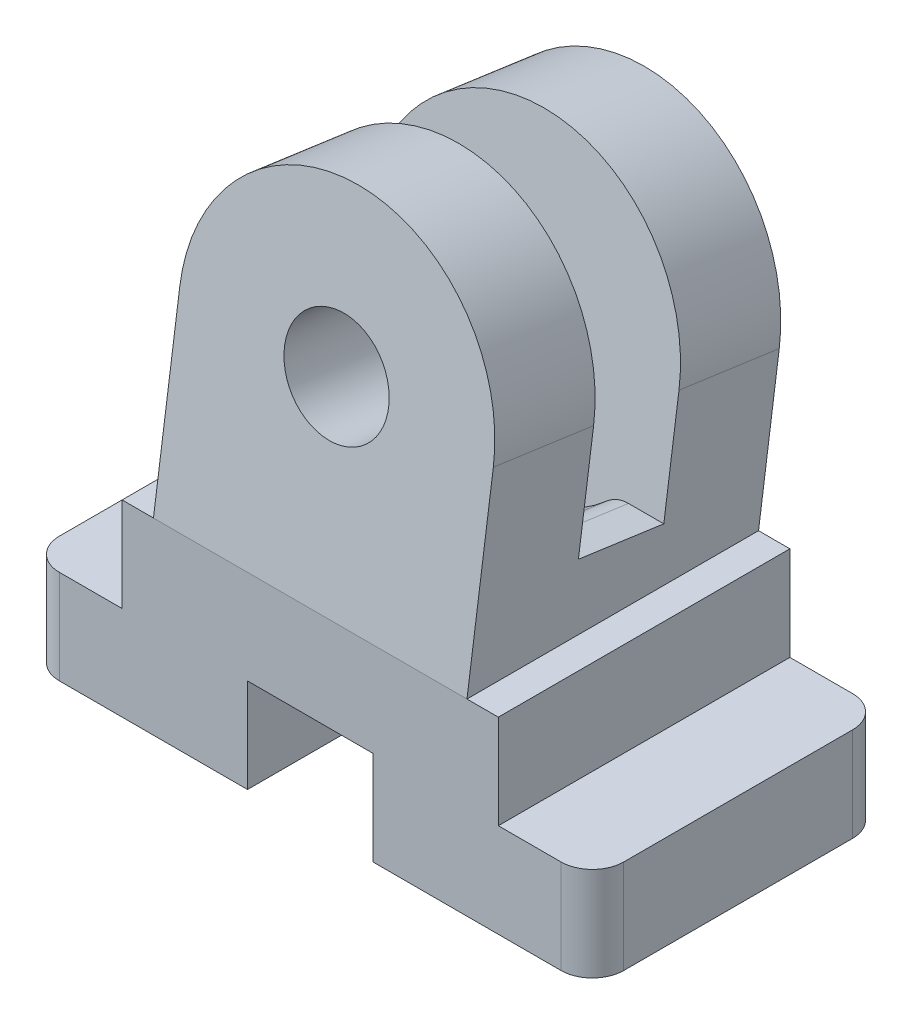
ISO-10303-21;
HEADER;
FILE_DESCRIPTION(('STEP AP214'),'2;1');
FILE_NAME('part.step','',(''),(''),'','','');
FILE_SCHEMA(('AUTOMOTIVE_DESIGN { 1 0 10303 214 1 1 1 1 }'));
ENDSEC;
DATA;
#1=APPLICATION_CONTEXT('core data for automotive mechanical design processes');
#2=APPLICATION_PROTOCOL_DEFINITION('international standard','automotive_design',2000,#1);
#3=PRODUCT_CONTEXT('',#1,'mechanical');
#4=PRODUCT('Part','Part','',(#3));
#5=PRODUCT_RELATED_PRODUCT_CATEGORY('part','',(#4));
#6=PRODUCT_DEFINITION_FORMATION('','',#4);
#7=PRODUCT_DEFINITION_CONTEXT('part definition',#1,'design');
#8=PRODUCT_DEFINITION('design','',#6,#7);
#9=PRODUCT_DEFINITION_SHAPE('','',#8);
#10=(LENGTH_UNIT() NAMED_UNIT(*) SI_UNIT(.MILLI.,.METRE.));
#11=(NAMED_UNIT(*) PLANE_ANGLE_UNIT() SI_UNIT($,.RADIAN.));
#12=(NAMED_UNIT(*) SI_UNIT($,.STERADIAN.) SOLID_ANGLE_UNIT());
#13=UNCERTAINTY_MEASURE_WITH_UNIT(LENGTH_MEASURE(1.E-05),#10,'distance_accuracy_value','');
#14=(GEOMETRIC_REPRESENTATION_CONTEXT(3) GLOBAL_UNCERTAINTY_ASSIGNED_CONTEXT((#13)) GLOBAL_UNIT_ASSIGNED_CONTEXT((#10,
#11,#12)) REPRESENTATION_CONTEXT('',''));
#15=CARTESIAN_POINT('',(0.,0.,0.));
#16=DIRECTION('',(0.,0.,1.));
#17=DIRECTION('',(1.,0.,0.));
#18=AXIS2_PLACEMENT_3D('',#15,#16,#17);
#19=CARTESIAN_POINT('',(-5.,0.307577926005134,2.18853066197066));
#20=DIRECTION('',(0.,0.139173100960066,0.99026806874157));
#21=DIRECTION('',(0.,-0.99026806874157,0.139173100960066));
#22=AXIS2_PLACEMENT_3D('',#19,#20,#21);
#23=PLANE('',#22);
#24=CARTESIAN_POINT('',(0.,11.5321199850963,0.611024151833874));
#25=DIRECTION('',(0.,0.139173100960066,0.99026806874157));
#26=DIRECTION('',(0.,-0.99026806874157,0.139173100960066));
#27=AXIS2_PLACEMENT_3D('',#24,#25,#26);
#28=CIRCLE('',#27,1.6625);
#29=CARTESIAN_POINT('',(0.,9.88579932081348,0.842399432179984));
#30=VERTEX_POINT('',#29);
#31=EDGE_CURVE('E600',#30,#30,#28,.T.);
#32=ORIENTED_EDGE('',*,*,#31,.T.);
#33=EDGE_LOOP('',(#32));
#34=FACE_BOUND('',#33,.T.);
#35=DIRECTION('',(1.,0.,0.));
#36=VECTOR('',#35,1.);
#37=CARTESIAN_POINT('',(3.48250089734375,8.08351054709297,1.09569460081341));
#38=LINE('',#37,#36);
#39=CARTESIAN_POINT('',(3.87463684818494,8.08351054709297,1.09569460081341));
#40=VERTEX_POINT('',#39);
#41=CARTESIAN_POINT('',(5.,8.08351054709297,1.09569460081341));
#42=VERTEX_POINT('',#41);
#43=EDGE_CURVE('E583',#40,#42,#38,.T.);
#44=ORIENTED_EDGE('',*,*,#43,.F.);
#45=CARTESIAN_POINT('',(3.87463684818494,7.0932424783514,1.23486770177348));
#46=DIRECTION('',(0.,0.139173100960066,0.99026806874157));
#47=DIRECTION('',(0.,-0.99026806874157,0.139173100960066));
#48=AXIS2_PLACEMENT_3D('',#45,#46,#47);
#49=CIRCLE('',#48,1.);
#50=CARTESIAN_POINT('',(3.22068970081196,7.84242011662059,1.12957765115076));
#51=VERTEX_POINT('',#50);
#52=EDGE_CURVE('E98',#40,#51,#49,.T.);
#53=ORIENTED_EDGE('',*,*,#52,.T.);
#54=CARTESIAN_POINT('',(0.,11.5321199850963,0.611024151833875));
#55=DIRECTION('',(0.,0.139173100960066,0.99026806874157));
#56=DIRECTION('',(0.,-0.99026806874157,0.139173100960066));
#57=AXIS2_PLACEMENT_3D('',#54,#55,#56);
#58=CIRCLE('',#57,4.925);
#59=CARTESIAN_POINT('',(-3.22068970081196,7.84242011662059,1.12957765115076));
#60=VERTEX_POINT('',#59);
#61=EDGE_CURVE('E582',#60,#51,#58,.T.);
#62=ORIENTED_EDGE('',*,*,#61,.F.);
#63=CARTESIAN_POINT('',(-3.87463684818494,7.0932424783514,1.23486770177348));
#64=DIRECTION('',(0.,0.139173100960066,0.99026806874157));
#65=DIRECTION('',(0.,-0.99026806874157,0.139173100960066));
#66=AXIS2_PLACEMENT_3D('',#63,#64,#65);
#67=CIRCLE('',#66,1.);
#68=CARTESIAN_POINT('',(-3.87463684818494,8.08351054709297,1.09569460081341));
#69=VERTEX_POINT('',#68);
#70=EDGE_CURVE('E576',#60,#69,#67,.T.);
#71=ORIENTED_EDGE('',*,*,#70,.T.);
#72=DIRECTION('',(1.,0.,0.));
#73=VECTOR('',#72,1.);
#74=CARTESIAN_POINT('',(-3.48250089734375,8.08351054709297,1.09569460081341));
#75=LINE('',#74,#73);
#76=CARTESIAN_POINT('',(-5.,8.08351054709297,1.09569460081341));
#77=VERTEX_POINT('',#76);
#78=EDGE_CURVE('E286',#77,#69,#75,.T.);
#79=ORIENTED_EDGE('',*,*,#78,.F.);
#80=DIRECTION('',(0.,-0.99026806874157,0.139173100960066));
#81=VECTOR('',#80,1.);
#82=CARTESIAN_POINT('',(-5.,0.307577926005134,2.18853066197066));
#83=LINE('',#82,#81);
#84=CARTESIAN_POINT('',(-5.,11.5321199850963,0.611024151833876));
#85=VERTEX_POINT('',#84);
#86=EDGE_CURVE('E282',#85,#77,#83,.T.);
#87=ORIENTED_EDGE('',*,*,#86,.F.);
#88=CARTESIAN_POINT('',(0.,11.5321199850963,0.611024151833877));
#89=DIRECTION('',(0.,0.139173100960066,0.99026806874157));
#90=DIRECTION('',(0.,-0.99026806874157,0.139173100960066));
#91=AXIS2_PLACEMENT_3D('',#88,#89,#90);
#92=CIRCLE('',#91,5.);
#93=CARTESIAN_POINT('',(5.,11.5321199850964,0.611024151833878));
#94=VERTEX_POINT('',#93);
#95=EDGE_CURVE('E472',#94,#85,#92,.T.);
#96=ORIENTED_EDGE('',*,*,#95,.F.);
#97=DIRECTION('',(0.,-0.99026806874157,0.139173100960066));
#98=VECTOR('',#97,1.);
#99=CARTESIAN_POINT('',(5.,0.307577926005134,2.18853066197066));
#100=LINE('',#99,#98);
#101=EDGE_CURVE('E332',#94,#42,#100,.T.);
#102=ORIENTED_EDGE('',*,*,#101,.T.);
#103=EDGE_LOOP('',(#44,#53,#62,#71,#79,#87,#96,#102));
#104=FACE_BOUND('',#103,.T.);
#105=ADVANCED_FACE('F90',(#34,#104),#23,.F.);
#106=CARTESIAN_POINT('',(-5.,-0.0751481016350465,-0.53470652706866));
#107=DIRECTION('',(0.,-0.139173100960066,-0.99026806874157));
#108=DIRECTION('',(0.,0.99026806874157,-0.139173100960066));
#109=AXIS2_PLACEMENT_3D('',#106,#107,#108);
#110=PLANE('',#109);
#111=CARTESIAN_POINT('',(0.,11.1493939574562,-2.11221303720544));
#112=DIRECTION('',(0.,-0.139173100960066,-0.99026806874157));
#113=DIRECTION('',(0.,0.99026806874157,-0.139173100960066));
#114=AXIS2_PLACEMENT_3D('',#111,#112,#113);
#115=CIRCLE('',#114,1.6625);
#116=CARTESIAN_POINT('',(0.,12.795714621739,-2.34358831755155));
#117=VERTEX_POINT('',#116);
#118=EDGE_CURVE('E597',#117,#117,#115,.T.);
#119=ORIENTED_EDGE('',*,*,#118,.T.);
#120=EDGE_LOOP('',(#119));
#121=FACE_BOUND('',#120,.T.);
#122=CARTESIAN_POINT('',(0.,11.1493939574562,-2.11221303720544));
#123=DIRECTION('',(0.,-0.139173100960066,-0.99026806874157));
#124=DIRECTION('',(0.,0.99026806874157,-0.139173100960066));
#125=AXIS2_PLACEMENT_3D('',#122,#123,#124);
#126=CIRCLE('',#125,4.925);
#127=CARTESIAN_POINT('',(-3.22068970081196,7.45969408898041,-1.59365953788855));
#128=VERTEX_POINT('',#127);
#129=CARTESIAN_POINT('',(3.22068970081196,7.45969408898041,-1.59365953788855));
#130=VERTEX_POINT('',#129);
#131=EDGE_CURVE('E295',#128,#130,#126,.F.);
#132=ORIENTED_EDGE('',*,*,#131,.T.);
#133=CARTESIAN_POINT('',(3.87463684818494,6.71051645071122,-1.48836948726584));
#134=DIRECTION('',(0.,-0.139173100960066,-0.99026806874157));
#135=DIRECTION('',(0.,0.99026806874157,-0.139173100960066));
#136=AXIS2_PLACEMENT_3D('',#133,#134,#135);
#137=CIRCLE('',#136,1.);
#138=CARTESIAN_POINT('',(3.87463684818494,7.70078451945279,-1.6275425882259));
#139=VERTEX_POINT('',#138);
#140=EDGE_CURVE('E13',#130,#139,#137,.T.);
#141=ORIENTED_EDGE('',*,*,#140,.T.);
#142=DIRECTION('',(1.,0.,0.));
#143=VECTOR('',#142,1.);
#144=CARTESIAN_POINT('',(3.48250089734375,7.70078451945279,-1.6275425882259));
#145=LINE('',#144,#143);
#146=CARTESIAN_POINT('',(5.,7.70078451945279,-1.6275425882259));
#147=VERTEX_POINT('',#146);
#148=EDGE_CURVE('E475',#139,#147,#145,.T.);
#149=ORIENTED_EDGE('',*,*,#148,.T.);
#150=DIRECTION('',(0.,0.99026806874157,-0.139173100960066));
#151=VECTOR('',#150,1.);
#152=CARTESIAN_POINT('',(5.,-0.0751481016350465,-0.53470652706866));
#153=LINE('',#152,#151);
#154=CARTESIAN_POINT('',(5.,11.1493939574562,-2.11221303720544));
#155=VERTEX_POINT('',#154);
#156=EDGE_CURVE('E308',#147,#155,#153,.T.);
#157=ORIENTED_EDGE('',*,*,#156,.T.);
#158=CARTESIAN_POINT('',(0.,11.1493939574562,-2.11221303720544));
#159=DIRECTION('',(0.,-0.139173100960066,-0.99026806874157));
#160=DIRECTION('',(0.,0.99026806874157,-0.139173100960066));
#161=AXIS2_PLACEMENT_3D('',#158,#159,#160);
#162=CIRCLE('',#161,5.);
#163=CARTESIAN_POINT('',(-5.,11.1493939574562,-2.11221303720544));
#164=VERTEX_POINT('',#163);
#165=EDGE_CURVE('E300',#164,#155,#162,.T.);
#166=ORIENTED_EDGE('',*,*,#165,.F.);
#167=DIRECTION('',(0.,0.99026806874157,-0.139173100960066));
#168=VECTOR('',#167,1.);
#169=CARTESIAN_POINT('',(-5.,-0.0751481016350465,-0.53470652706866));
#170=LINE('',#169,#168);
#171=CARTESIAN_POINT('',(-5.,7.70078451945279,-1.6275425882259));
#172=VERTEX_POINT('',#171);
#173=EDGE_CURVE('E278',#172,#164,#170,.T.);
#174=ORIENTED_EDGE('',*,*,#173,.F.);
#175=DIRECTION('',(1.,0.,0.));
#176=VECTOR('',#175,1.);
#177=CARTESIAN_POINT('',(-3.48250089734375,7.70078451945279,-1.6275425882259));
#178=LINE('',#177,#176);
#179=CARTESIAN_POINT('',(-3.87463684818494,7.70078451945279,-1.6275425882259));
#180=VERTEX_POINT('',#179);
#181=EDGE_CURVE('E290',#172,#180,#178,.T.);
#182=ORIENTED_EDGE('',*,*,#181,.T.);
#183=CARTESIAN_POINT('',(-3.87463684818494,6.71051645071122,-1.48836948726584));
#184=DIRECTION('',(0.,-0.139173100960066,-0.99026806874157));
#185=DIRECTION('',(0.,0.99026806874157,-0.139173100960066));
#186=AXIS2_PLACEMENT_3D('',#183,#184,#185);
#187=CIRCLE('',#186,1.);
#188=EDGE_CURVE('E578',#180,#128,#187,.T.);
#189=ORIENTED_EDGE('',*,*,#188,.T.);
#190=EDGE_LOOP('',(#132,#141,#149,#157,#166,#174,#182,#189));
#191=FACE_BOUND('',#190,.T.);
#192=ADVANCED_FACE('F298',(#121,#191),#110,.F.);
#193=CARTESIAN_POINT('',(0.,6.,0.));
#194=DIRECTION('',(0.,1.,0.));
#195=DIRECTION('',(0.,0.,1.));
#196=AXIS2_PLACEMENT_3D('',#193,#194,#195);
#197=PLANE('',#196);
#198=DIRECTION('',(-1.,0.,0.));
#199=VECTOR('',#198,1.);
#200=CARTESIAN_POINT('',(-6.,6.,-4.65));
#201=LINE('',#200,#199);
#202=CARTESIAN_POINT('',(6.,6.,-4.65));
#203=VERTEX_POINT('',#202);
#204=CARTESIAN_POINT('',(5.,6.,-4.65));
#205=VERTEX_POINT('',#204);
#206=EDGE_CURVE('E349',#203,#205,#201,.T.);
#207=ORIENTED_EDGE('',*,*,#206,.T.);
#208=DIRECTION('',(0.,0.,1.));
#209=VECTOR('',#208,1.);
#210=CARTESIAN_POINT('',(5.,6.,0.));
#211=LINE('',#210,#209);
#212=CARTESIAN_POINT('',(5.,6.,4.65));
#213=VERTEX_POINT('',#212);
#214=EDGE_CURVE('E337',#205,#213,#211,.T.);
#215=ORIENTED_EDGE('',*,*,#214,.T.);
#216=DIRECTION('',(1.,0.,0.));
#217=VECTOR('',#216,1.);
#218=CARTESIAN_POINT('',(-6.,6.,4.65));
#219=LINE('',#218,#217);
#220=CARTESIAN_POINT('',(6.,6.,4.65));
#221=VERTEX_POINT('',#220);
#222=EDGE_CURVE('E385',#213,#221,#219,.T.);
#223=ORIENTED_EDGE('',*,*,#222,.T.);
#224=DIRECTION('',(0.,0.,-1.));
#225=VECTOR('',#224,1.);
#226=CARTESIAN_POINT('',(6.,6.,-4.65));
#227=LINE('',#226,#225);
#228=EDGE_CURVE('E359',#221,#203,#227,.T.);
#229=ORIENTED_EDGE('',*,*,#228,.T.);
#230=EDGE_LOOP('',(#207,#215,#223,#229));
#231=FACE_BOUND('',#230,.T.);
#232=ADVANCED_FACE('F450',(#231),#197,.T.);
#233=DIRECTION('',(0.,0.,1.));
#234=VECTOR('',#233,1.);
#235=CARTESIAN_POINT('',(-5.,6.,0.));
#236=LINE('',#235,#234);
#237=CARTESIAN_POINT('',(-5.,6.,-4.65));
#238=VERTEX_POINT('',#237);
#239=CARTESIAN_POINT('',(-5.,6.,4.65));
#240=VERTEX_POINT('',#239);
#241=EDGE_CURVE('E346',#238,#240,#236,.T.);
#242=ORIENTED_EDGE('',*,*,#241,.F.);
#243=CARTESIAN_POINT('',(-6.,6.,-4.65));
#244=VERTEX_POINT('',#243);
#245=EDGE_CURVE('E354',#238,#244,#201,.T.);
#246=ORIENTED_EDGE('',*,*,#245,.T.);
#247=DIRECTION('',(0.,0.,1.));
#248=VECTOR('',#247,1.);
#249=CARTESIAN_POINT('',(-6.,6.,-4.65));
#250=LINE('',#249,#248);
#251=CARTESIAN_POINT('',(-6.,6.,4.65));
#252=VERTEX_POINT('',#251);
#253=EDGE_CURVE('E371',#244,#252,#250,.T.);
#254=ORIENTED_EDGE('',*,*,#253,.T.);
#255=EDGE_CURVE('E381',#252,#240,#219,.T.);
#256=ORIENTED_EDGE('',*,*,#255,.T.);
#257=EDGE_LOOP('',(#242,#246,#254,#256));
#258=FACE_BOUND('',#257,.T.);
#259=ADVANCED_FACE('F404',(#258),#197,.T.);
#260=CARTESIAN_POINT('',(0.,3.,0.));
#261=DIRECTION('',(0.,1.,0.));
#262=DIRECTION('',(0.,0.,1.));
#263=AXIS2_PLACEMENT_3D('',#260,#261,#262);
#264=PLANE('',#263);
#265=DIRECTION('',(0.,0.,-1.));
#266=VECTOR('',#265,1.);
#267=CARTESIAN_POINT('',(9.,3.,-4.65));
#268=LINE('',#267,#266);
#269=CARTESIAN_POINT('',(9.,3.,3.65));
#270=VERTEX_POINT('',#269);
#271=CARTESIAN_POINT('',(9.,3.,-3.65));
#272=VERTEX_POINT('',#271);
#273=EDGE_CURVE('E486',#270,#272,#268,.T.);
#274=ORIENTED_EDGE('',*,*,#273,.T.);
#275=CARTESIAN_POINT('',(8.,3.,-3.65));
#276=DIRECTION('',(0.,1.,0.));
#277=DIRECTION('',(0.,0.,1.));
#278=AXIS2_PLACEMENT_3D('',#275,#276,#277);
#279=CIRCLE('',#278,1.);
#280=CARTESIAN_POINT('',(8.,3.,-4.65));
#281=VERTEX_POINT('',#280);
#282=EDGE_CURVE('E313',#272,#281,#279,.T.);
#283=ORIENTED_EDGE('',*,*,#282,.T.);
#284=DIRECTION('',(-1.,0.,0.));
#285=VECTOR('',#284,1.);
#286=CARTESIAN_POINT('',(-9.,3.,-4.65));
#287=LINE('',#286,#285);
#288=CARTESIAN_POINT('',(6.,3.,-4.65));
#289=VERTEX_POINT('',#288);
#290=EDGE_CURVE('E481',#281,#289,#287,.T.);
#291=ORIENTED_EDGE('',*,*,#290,.T.);
#292=DIRECTION('',(0.,0.,-1.));
#293=VECTOR('',#292,1.);
#294=CARTESIAN_POINT('',(6.,3.,-4.65));
#295=LINE('',#294,#293);
#296=CARTESIAN_POINT('',(6.,3.,4.65));
#297=VERTEX_POINT('',#296);
#298=EDGE_CURVE('E367',#297,#289,#295,.T.);
#299=ORIENTED_EDGE('',*,*,#298,.F.);
#300=DIRECTION('',(1.,0.,0.));
#301=VECTOR('',#300,1.);
#302=CARTESIAN_POINT('',(-9.,3.,4.65));
#303=LINE('',#302,#301);
#304=CARTESIAN_POINT('',(8.,3.,4.65));
#305=VERTEX_POINT('',#304);
#306=EDGE_CURVE('E637',#297,#305,#303,.T.);
#307=ORIENTED_EDGE('',*,*,#306,.T.);
#308=CARTESIAN_POINT('',(8.,3.,3.65));
#309=DIRECTION('',(0.,1.,0.));
#310=DIRECTION('',(0.,0.,1.));
#311=AXIS2_PLACEMENT_3D('',#308,#309,#310);
#312=CIRCLE('',#311,1.);
#313=EDGE_CURVE('E559',#305,#270,#312,.T.);
#314=ORIENTED_EDGE('',*,*,#313,.T.);
#315=EDGE_LOOP('',(#274,#283,#291,#299,#307,#314));
#316=FACE_BOUND('',#315,.T.);
#317=ADVANCED_FACE('F678',(#316),#264,.T.);
#318=CARTESIAN_POINT('',(0.,0.,0.));
#319=DIRECTION('',(0.,1.,0.));
#320=DIRECTION('',(0.,0.,1.));
#321=AXIS2_PLACEMENT_3D('',#318,#319,#320);
#322=PLANE('',#321);
#323=DIRECTION('',(-1.,0.,0.));
#324=VECTOR('',#323,1.);
#325=CARTESIAN_POINT('',(-9.,0.,-4.65));
#326=LINE('',#325,#324);
#327=CARTESIAN_POINT('',(8.,0.,-4.65));
#328=VERTEX_POINT('',#327);
#329=CARTESIAN_POINT('',(2.,0.,-4.65));
#330=VERTEX_POINT('',#329);
#331=EDGE_CURVE('E502',#328,#330,#326,.T.);
#332=ORIENTED_EDGE('',*,*,#331,.F.);
#333=CARTESIAN_POINT('',(8.,0.,-3.65));
#334=DIRECTION('',(0.,1.,0.));
#335=DIRECTION('',(0.,0.,1.));
#336=AXIS2_PLACEMENT_3D('',#333,#334,#335);
#337=CIRCLE('',#336,1.);
#338=CARTESIAN_POINT('',(9.,0.,-3.65));
#339=VERTEX_POINT('',#338);
#340=EDGE_CURVE('E553',#328,#339,#337,.F.);
#341=ORIENTED_EDGE('',*,*,#340,.T.);
#342=DIRECTION('',(0.,0.,-1.));
#343=VECTOR('',#342,1.);
#344=CARTESIAN_POINT('',(9.,0.,-4.65));
#345=LINE('',#344,#343);
#346=CARTESIAN_POINT('',(9.,0.,3.65));
#347=VERTEX_POINT('',#346);
#348=EDGE_CURVE('E507',#347,#339,#345,.T.);
#349=ORIENTED_EDGE('',*,*,#348,.F.);
#350=CARTESIAN_POINT('',(8.,0.,3.65));
#351=DIRECTION('',(0.,1.,0.));
#352=DIRECTION('',(0.,0.,1.));
#353=AXIS2_PLACEMENT_3D('',#350,#351,#352);
#354=CIRCLE('',#353,1.);
#355=CARTESIAN_POINT('',(8.,0.,4.65));
#356=VERTEX_POINT('',#355);
#357=EDGE_CURVE('E551',#347,#356,#354,.F.);
#358=ORIENTED_EDGE('',*,*,#357,.T.);
#359=DIRECTION('',(1.,0.,0.));
#360=VECTOR('',#359,1.);
#361=CARTESIAN_POINT('',(-9.,0.,4.65));
#362=LINE('',#361,#360);
#363=CARTESIAN_POINT('',(2.,0.,4.65));
#364=VERTEX_POINT('',#363);
#365=EDGE_CURVE('E510',#364,#356,#362,.T.);
#366=ORIENTED_EDGE('',*,*,#365,.F.);
#367=DIRECTION('',(0.,0.,1.));
#368=VECTOR('',#367,1.);
#369=CARTESIAN_POINT('',(2.,0.,4.65));
#370=LINE('',#369,#368);
#371=EDGE_CURVE('E604',#330,#364,#370,.T.);
#372=ORIENTED_EDGE('',*,*,#371,.F.);
#373=EDGE_LOOP('',(#332,#341,#349,#358,#366,#372));
#374=FACE_BOUND('',#373,.T.);
#375=ADVANCED_FACE('F628',(#374),#322,.F.);
#376=CARTESIAN_POINT('',(-5.,0.757071764459568,5.38684551050759));
#377=DIRECTION('',(0.,-0.139173100960066,-0.99026806874157));
#378=DIRECTION('',(0.,0.99026806874157,-0.139173100960066));
#379=AXIS2_PLACEMENT_3D('',#376,#377,#378);
#380=PLANE('',#379);
#381=CARTESIAN_POINT('',(0.,11.9816138235508,3.80933900037081));
#382=DIRECTION('',(0.,0.139173100960066,0.99026806874157));
#383=DIRECTION('',(0.,-0.99026806874157,0.139173100960066));
#384=AXIS2_PLACEMENT_3D('',#381,#382,#383);
#385=CIRCLE('',#384,1.6625);
#386=CARTESIAN_POINT('',(0.,10.3352931592679,4.04071428071692));
#387=VERTEX_POINT('',#386);
#388=EDGE_CURVE('E589',#387,#387,#385,.T.);
#389=ORIENTED_EDGE('',*,*,#388,.F.);
#390=EDGE_LOOP('',(#389));
#391=FACE_BOUND('',#390,.T.);
#392=DIRECTION('',(0.,0.99026806874157,-0.139173100960066));
#393=VECTOR('',#392,1.);
#394=CARTESIAN_POINT('',(5.,0.757071764459568,5.38684551050759));
#395=LINE('',#394,#393);
#396=CARTESIAN_POINT('',(5.,11.9816138235508,3.80933900037081));
#397=VERTEX_POINT('',#396);
#398=EDGE_CURVE('E336',#213,#397,#395,.T.);
#399=ORIENTED_EDGE('',*,*,#398,.T.);
#400=CARTESIAN_POINT('',(0.,11.9816138235508,3.80933900037081));
#401=DIRECTION('',(0.,0.139173100960066,0.99026806874157));
#402=DIRECTION('',(0.,-0.99026806874157,0.139173100960066));
#403=AXIS2_PLACEMENT_3D('',#400,#401,#402);
#404=CIRCLE('',#403,5.);
#405=CARTESIAN_POINT('',(-5.,11.9816138235508,3.80933900037081));
#406=VERTEX_POINT('',#405);
#407=EDGE_CURVE('E434',#397,#406,#404,.T.);
#408=ORIENTED_EDGE('',*,*,#407,.T.);
#409=DIRECTION('',(0.,0.99026806874157,-0.139173100960066));
#410=VECTOR('',#409,1.);
#411=CARTESIAN_POINT('',(-5.,0.757071764459568,5.38684551050759));
#412=LINE('',#411,#410);
#413=EDGE_CURVE('E429',#240,#406,#412,.T.);
#414=ORIENTED_EDGE('',*,*,#413,.F.);
#415=DIRECTION('',(1.,0.,0.));
#416=VECTOR('',#415,1.);
#417=CARTESIAN_POINT('',(-5.,6.,4.65));
#418=LINE('',#417,#416);
#419=EDGE_CURVE('E424',#240,#213,#418,.T.);
#420=ORIENTED_EDGE('',*,*,#419,.T.);
#421=EDGE_LOOP('',(#399,#408,#414,#420));
#422=FACE_BOUND('',#421,.T.);
#423=ADVANCED_FACE('F433',(#391,#422),#380,.F.);
#424=CARTESIAN_POINT('',(-5.,-0.52464194008948,-3.73302137560559));
#425=DIRECTION('',(0.,0.139173100960066,0.99026806874157));
#426=DIRECTION('',(0.,-0.99026806874157,0.139173100960066));
#427=AXIS2_PLACEMENT_3D('',#424,#425,#426);
#428=PLANE('',#427);
#429=CARTESIAN_POINT('',(0.,10.6999001190017,-5.31052788574237));
#430=DIRECTION('',(0.,0.139173100960066,0.99026806874157));
#431=DIRECTION('',(0.,-0.99026806874157,0.139173100960066));
#432=AXIS2_PLACEMENT_3D('',#429,#430,#431);
#433=CIRCLE('',#432,1.6625);
#434=CARTESIAN_POINT('',(0.,9.05357945471887,-5.07915260539626));
#435=VERTEX_POINT('',#434);
#436=EDGE_CURVE('E338',#435,#435,#433,.T.);
#437=ORIENTED_EDGE('',*,*,#436,.T.);
#438=EDGE_LOOP('',(#437));
#439=FACE_BOUND('',#438,.T.);
#440=CARTESIAN_POINT('',(0.,10.6999001190017,-5.31052788574237));
#441=DIRECTION('',(0.,0.139173100960066,0.99026806874157));
#442=DIRECTION('',(0.,-0.99026806874157,0.139173100960066));
#443=AXIS2_PLACEMENT_3D('',#440,#441,#442);
#444=CIRCLE('',#443,5.);
#445=CARTESIAN_POINT('',(5.,10.6999001190017,-5.31052788574237));
#446=VERTEX_POINT('',#445);
#447=CARTESIAN_POINT('',(-5.,10.6999001190017,-5.31052788574237));
#448=VERTEX_POINT('',#447);
#449=EDGE_CURVE('E469',#446,#448,#444,.T.);
#450=ORIENTED_EDGE('',*,*,#449,.F.);
#451=DIRECTION('',(0.,-0.99026806874157,0.139173100960066));
#452=VECTOR('',#451,1.);
#453=CARTESIAN_POINT('',(5.,-0.52464194008948,-3.73302137560559));
#454=LINE('',#453,#452);
#455=EDGE_CURVE('E302',#446,#205,#454,.T.);
#456=ORIENTED_EDGE('',*,*,#455,.T.);
#457=DIRECTION('',(1.,0.,0.));
#458=VECTOR('',#457,1.);
#459=CARTESIAN_POINT('',(-5.,6.,-4.65));
#460=LINE('',#459,#458);
#461=EDGE_CURVE('E305',#238,#205,#460,.T.);
#462=ORIENTED_EDGE('',*,*,#461,.F.);
#463=DIRECTION('',(0.,-0.99026806874157,0.139173100960066));
#464=VECTOR('',#463,1.);
#465=CARTESIAN_POINT('',(-5.,-0.52464194008948,-3.73302137560559));
#466=LINE('',#465,#464);
#467=EDGE_CURVE('E301',#448,#238,#466,.T.);
#468=ORIENTED_EDGE('',*,*,#467,.F.);
#469=EDGE_LOOP('',(#450,#456,#462,#468));
#470=FACE_BOUND('',#469,.T.);
#471=ADVANCED_FACE('F446',(#439,#470),#428,.F.);
#472=CARTESIAN_POINT('',(5.,0.,0.));
#473=DIRECTION('',(1.,0.,0.));
#474=DIRECTION('',(0.,0.,-1.));
#475=AXIS2_PLACEMENT_3D('',#472,#473,#474);
#476=PLANE('',#475);
#477=ORIENTED_EDGE('',*,*,#455,.F.);
#478=DIRECTION('',(0.,0.139173100960066,0.99026806874157));
#479=VECTOR('',#478,1.);
#480=CARTESIAN_POINT('',(5.,10.3967454175413,-7.46758566971223));
#481=LINE('',#480,#479);
#482=EDGE_CURVE('E327',#446,#155,#481,.T.);
#483=ORIENTED_EDGE('',*,*,#482,.T.);
#484=ORIENTED_EDGE('',*,*,#156,.F.);
#485=DIRECTION('',(0.,0.139173100960066,0.99026806874157));
#486=VECTOR('',#485,1.);
#487=CARTESIAN_POINT('',(5.,6.27858278742775,-11.7470337313992));
#488=LINE('',#487,#486);
#489=EDGE_CURVE('E287',#147,#42,#488,.T.);
#490=ORIENTED_EDGE('',*,*,#489,.T.);
#491=ORIENTED_EDGE('',*,*,#101,.F.);
#492=DIRECTION('',(0.,0.139173100960066,0.99026806874157));
#493=VECTOR('',#492,1.);
#494=CARTESIAN_POINT('',(5.,10.3967454175413,-7.46758566971223));
#495=LINE('',#494,#493);
#496=EDGE_CURVE('E456',#94,#397,#495,.T.);
#497=ORIENTED_EDGE('',*,*,#496,.T.);
#498=ORIENTED_EDGE('',*,*,#398,.F.);
#499=ORIENTED_EDGE('',*,*,#214,.F.);
#500=EDGE_LOOP('',(#477,#483,#484,#490,#491,#497,#498,#499));
#501=FACE_BOUND('',#500,.T.);
#502=ADVANCED_FACE('F452',(#501),#476,.T.);
#503=CARTESIAN_POINT('',(-5.,0.,0.));
#504=DIRECTION('',(1.,0.,0.));
#505=DIRECTION('',(0.,0.,-1.));
#506=AXIS2_PLACEMENT_3D('',#503,#504,#505);
#507=PLANE('',#506);
#508=DIRECTION('',(0.,0.139173100960066,0.99026806874157));
#509=VECTOR('',#508,1.);
#510=CARTESIAN_POINT('',(-5.,10.3967454175413,-7.46758566971223));
#511=LINE('',#510,#509);
#512=EDGE_CURVE('E331',#448,#164,#511,.T.);
#513=ORIENTED_EDGE('',*,*,#512,.F.);
#514=ORIENTED_EDGE('',*,*,#467,.T.);
#515=ORIENTED_EDGE('',*,*,#241,.T.);
#516=ORIENTED_EDGE('',*,*,#413,.T.);
#517=DIRECTION('',(0.,0.139173100960066,0.99026806874157));
#518=VECTOR('',#517,1.);
#519=CARTESIAN_POINT('',(-5.,10.3967454175413,-7.46758566971223));
#520=LINE('',#519,#518);
#521=EDGE_CURVE('E461',#85,#406,#520,.T.);
#522=ORIENTED_EDGE('',*,*,#521,.F.);
#523=ORIENTED_EDGE('',*,*,#86,.T.);
#524=DIRECTION('',(0.,0.139173100960066,0.99026806874157));
#525=VECTOR('',#524,1.);
#526=CARTESIAN_POINT('',(-5.,6.27858278742775,-11.7470337313992));
#527=LINE('',#526,#525);
#528=EDGE_CURVE('E273',#172,#77,#527,.T.);
#529=ORIENTED_EDGE('',*,*,#528,.F.);
#530=ORIENTED_EDGE('',*,*,#173,.T.);
#531=EDGE_LOOP('',(#513,#514,#515,#516,#522,#523,#529,#530));
#532=FACE_BOUND('',#531,.T.);
#533=ADVANCED_FACE('F276',(#532),#507,.F.);
#534=CARTESIAN_POINT('',(-6.,3.,-4.65));
#535=VERTEX_POINT('',#534);
#536=CARTESIAN_POINT('',(-8.,3.,-4.65));
#537=VERTEX_POINT('',#536);
#538=EDGE_CURVE('E413',#535,#537,#287,.T.);
#539=ORIENTED_EDGE('',*,*,#538,.T.);
#540=CARTESIAN_POINT('',(-8.,3.,-3.65));
#541=DIRECTION('',(0.,1.,0.));
#542=DIRECTION('',(0.,0.,1.));
#543=AXIS2_PLACEMENT_3D('',#540,#541,#542);
#544=CIRCLE('',#543,1.);
#545=CARTESIAN_POINT('',(-9.,3.,-3.65));
#546=VERTEX_POINT('',#545);
#547=EDGE_CURVE('E543',#537,#546,#544,.T.);
#548=ORIENTED_EDGE('',*,*,#547,.T.);
#549=DIRECTION('',(0.,0.,1.));
#550=VECTOR('',#549,1.);
#551=CARTESIAN_POINT('',(-9.,3.,-4.65));
#552=LINE('',#551,#550);
#553=CARTESIAN_POINT('',(-9.,3.,3.65));
#554=VERTEX_POINT('',#553);
#555=EDGE_CURVE('E364',#546,#554,#552,.T.);
#556=ORIENTED_EDGE('',*,*,#555,.T.);
#557=CARTESIAN_POINT('',(-8.,3.,3.65));
#558=DIRECTION('',(0.,1.,0.));
#559=DIRECTION('',(0.,0.,1.));
#560=AXIS2_PLACEMENT_3D('',#557,#558,#559);
#561=CIRCLE('',#560,1.);
#562=CARTESIAN_POINT('',(-8.,3.,4.65));
#563=VERTEX_POINT('',#562);
#564=EDGE_CURVE('E535',#554,#563,#561,.T.);
#565=ORIENTED_EDGE('',*,*,#564,.T.);
#566=CARTESIAN_POINT('',(-6.,3.,4.65));
#567=VERTEX_POINT('',#566);
#568=EDGE_CURVE('E636',#563,#567,#303,.T.);
#569=ORIENTED_EDGE('',*,*,#568,.T.);
#570=DIRECTION('',(0.,0.,1.));
#571=VECTOR('',#570,1.);
#572=CARTESIAN_POINT('',(-6.,3.,-4.65));
#573=LINE('',#572,#571);
#574=EDGE_CURVE('E372',#535,#567,#573,.T.);
#575=ORIENTED_EDGE('',*,*,#574,.F.);
#576=EDGE_LOOP('',(#539,#548,#556,#565,#569,#575));
#577=FACE_BOUND('',#576,.T.);
#578=ADVANCED_FACE('F640',(#577),#264,.T.);
#579=CARTESIAN_POINT('',(-9.,3.,-4.65));
#580=DIRECTION('',(1.,0.,0.));
#581=DIRECTION('',(0.,0.,-1.));
#582=AXIS2_PLACEMENT_3D('',#579,#580,#581);
#583=PLANE('',#582);
#584=ORIENTED_EDGE('',*,*,#555,.F.);
#585=DIRECTION('',(0.,-1.,0.));
#586=VECTOR('',#585,1.);
#587=CARTESIAN_POINT('',(-9.,3.,-3.65));
#588=LINE('',#587,#586);
#589=CARTESIAN_POINT('',(-9.,0.,-3.65));
#590=VERTEX_POINT('',#589);
#591=EDGE_CURVE('E528',#546,#590,#588,.T.);
#592=ORIENTED_EDGE('',*,*,#591,.T.);
#593=DIRECTION('',(0.,0.,1.));
#594=VECTOR('',#593,1.);
#595=CARTESIAN_POINT('',(-9.,0.,-4.65));
#596=LINE('',#595,#594);
#597=CARTESIAN_POINT('',(-9.,0.,3.65));
#598=VERTEX_POINT('',#597);
#599=EDGE_CURVE('E378',#590,#598,#596,.T.);
#600=ORIENTED_EDGE('',*,*,#599,.T.);
#601=DIRECTION('',(0.,-1.,0.));
#602=VECTOR('',#601,1.);
#603=CARTESIAN_POINT('',(-9.,3.,3.65));
#604=LINE('',#603,#602);
#605=EDGE_CURVE('E330',#598,#554,#604,.F.);
#606=ORIENTED_EDGE('',*,*,#605,.T.);
#607=EDGE_LOOP('',(#584,#592,#600,#606));
#608=FACE_BOUND('',#607,.T.);
#609=ADVANCED_FACE('F525',(#608),#583,.F.);
#610=CARTESIAN_POINT('',(-9.,3.,4.65));
#611=DIRECTION('',(0.,0.,-1.));
#612=DIRECTION('',(-1.,0.,0.));
#613=AXIS2_PLACEMENT_3D('',#610,#611,#612);
#614=PLANE('',#613);
#615=ORIENTED_EDGE('',*,*,#568,.F.);
#616=DIRECTION('',(0.,-1.,0.));
#617=VECTOR('',#616,1.);
#618=CARTESIAN_POINT('',(-8.,3.,4.65));
#619=LINE('',#618,#617);
#620=CARTESIAN_POINT('',(-8.,0.,4.65));
#621=VERTEX_POINT('',#620);
#622=EDGE_CURVE('E549',#563,#621,#619,.T.);
#623=ORIENTED_EDGE('',*,*,#622,.T.);
#624=CARTESIAN_POINT('',(-2.,0.,4.65));
#625=VERTEX_POINT('',#624);
#626=EDGE_CURVE('E509',#621,#625,#362,.T.);
#627=ORIENTED_EDGE('',*,*,#626,.T.);
#628=DIRECTION('',(0.,-1.,0.));
#629=VECTOR('',#628,1.);
#630=CARTESIAN_POINT('',(-2.,13.1237344888139,4.65));
#631=LINE('',#630,#629);
#632=CARTESIAN_POINT('',(-2.,3.,4.65));
#633=VERTEX_POINT('',#632);
#634=EDGE_CURVE('E612',#633,#625,#631,.T.);
#635=ORIENTED_EDGE('',*,*,#634,.F.);
#636=DIRECTION('',(-1.,0.,0.));
#637=VECTOR('',#636,1.);
#638=CARTESIAN_POINT('',(-2.,3.,4.65));
#639=LINE('',#638,#637);
#640=CARTESIAN_POINT('',(2.,3.,4.65));
#641=VERTEX_POINT('',#640);
#642=EDGE_CURVE('E613',#641,#633,#639,.T.);
#643=ORIENTED_EDGE('',*,*,#642,.F.);
#644=DIRECTION('',(0.,-1.,0.));
#645=VECTOR('',#644,1.);
#646=CARTESIAN_POINT('',(2.,13.1237344888139,4.65));
#647=LINE('',#646,#645);
#648=EDGE_CURVE('E616',#641,#364,#647,.T.);
#649=ORIENTED_EDGE('',*,*,#648,.T.);
#650=ORIENTED_EDGE('',*,*,#365,.T.);
#651=DIRECTION('',(0.,-1.,0.));
#652=VECTOR('',#651,1.);
#653=CARTESIAN_POINT('',(8.,3.,4.65));
#654=LINE('',#653,#652);
#655=EDGE_CURVE('E547',#356,#305,#654,.F.);
#656=ORIENTED_EDGE('',*,*,#655,.T.);
#657=ORIENTED_EDGE('',*,*,#306,.F.);
#658=DIRECTION('',(0.,-1.,0.));
#659=VECTOR('',#658,1.);
#660=CARTESIAN_POINT('',(6.,6.,4.65));
#661=LINE('',#660,#659);
#662=EDGE_CURVE('E394',#221,#297,#661,.T.);
#663=ORIENTED_EDGE('',*,*,#662,.F.);
#664=ORIENTED_EDGE('',*,*,#222,.F.);
#665=ORIENTED_EDGE('',*,*,#419,.F.);
#666=ORIENTED_EDGE('',*,*,#255,.F.);
#667=DIRECTION('',(0.,-1.,0.));
#668=VECTOR('',#667,1.);
#669=CARTESIAN_POINT('',(-6.,6.,4.65));
#670=LINE('',#669,#668);
#671=EDGE_CURVE('E384',#252,#567,#670,.T.);
#672=ORIENTED_EDGE('',*,*,#671,.T.);
#673=EDGE_LOOP('',(#615,#623,#627,#635,#643,#649,#650,#656,#657,#663,#664,#665,#666,#672));
#674=FACE_BOUND('',#673,.T.);
#675=ADVANCED_FACE('F421',(#674),#614,.F.);
#676=CARTESIAN_POINT('',(9.,3.,-4.65));
#677=DIRECTION('',(-1.,0.,0.));
#678=DIRECTION('',(0.,0.,1.));
#679=AXIS2_PLACEMENT_3D('',#676,#677,#678);
#680=PLANE('',#679);
#681=ORIENTED_EDGE('',*,*,#348,.T.);
#682=DIRECTION('',(0.,-1.,0.));
#683=VECTOR('',#682,1.);
#684=CARTESIAN_POINT('',(9.,3.,-3.65));
#685=LINE('',#684,#683);
#686=EDGE_CURVE('E558',#339,#272,#685,.F.);
#687=ORIENTED_EDGE('',*,*,#686,.T.);
#688=ORIENTED_EDGE('',*,*,#273,.F.);
#689=DIRECTION('',(0.,-1.,0.));
#690=VECTOR('',#689,1.);
#691=CARTESIAN_POINT('',(9.,3.,3.65));
#692=LINE('',#691,#690);
#693=EDGE_CURVE('E555',#270,#347,#692,.T.);
#694=ORIENTED_EDGE('',*,*,#693,.T.);
#695=EDGE_LOOP('',(#681,#687,#688,#694));
#696=FACE_BOUND('',#695,.T.);
#697=ADVANCED_FACE('F634',(#696),#680,.F.);
#698=CARTESIAN_POINT('',(-9.,3.,-4.65));
#699=DIRECTION('',(0.,0.,1.));
#700=DIRECTION('',(1.,0.,0.));
#701=AXIS2_PLACEMENT_3D('',#698,#699,#700);
#702=PLANE('',#701);
#703=CARTESIAN_POINT('',(-2.,0.,-4.65));
#704=VERTEX_POINT('',#703);
#705=CARTESIAN_POINT('',(-8.,0.,-4.65));
#706=VERTEX_POINT('',#705);
#707=EDGE_CURVE('E506',#704,#706,#326,.T.);
#708=ORIENTED_EDGE('',*,*,#707,.T.);
#709=DIRECTION('',(0.,-1.,0.));
#710=VECTOR('',#709,1.);
#711=CARTESIAN_POINT('',(-8.,3.,-4.65));
#712=LINE('',#711,#710);
#713=EDGE_CURVE('E539',#706,#537,#712,.F.);
#714=ORIENTED_EDGE('',*,*,#713,.T.);
#715=ORIENTED_EDGE('',*,*,#538,.F.);
#716=DIRECTION('',(0.,-1.,0.));
#717=VECTOR('',#716,1.);
#718=CARTESIAN_POINT('',(-6.,6.,-4.65));
#719=LINE('',#718,#717);
#720=EDGE_CURVE('E353',#244,#535,#719,.T.);
#721=ORIENTED_EDGE('',*,*,#720,.F.);
#722=ORIENTED_EDGE('',*,*,#245,.F.);
#723=ORIENTED_EDGE('',*,*,#461,.T.);
#724=ORIENTED_EDGE('',*,*,#206,.F.);
#725=DIRECTION('',(0.,-1.,0.));
#726=VECTOR('',#725,1.);
#727=CARTESIAN_POINT('',(6.,6.,-4.65));
#728=LINE('',#727,#726);
#729=EDGE_CURVE('E375',#203,#289,#728,.T.);
#730=ORIENTED_EDGE('',*,*,#729,.T.);
#731=ORIENTED_EDGE('',*,*,#290,.F.);
#732=DIRECTION('',(0.,-1.,0.));
#733=VECTOR('',#732,1.);
#734=CARTESIAN_POINT('',(8.,3.,-4.65));
#735=LINE('',#734,#733);
#736=EDGE_CURVE('E493',#281,#328,#735,.T.);
#737=ORIENTED_EDGE('',*,*,#736,.T.);
#738=ORIENTED_EDGE('',*,*,#331,.T.);
#739=DIRECTION('',(0.,-1.,0.));
#740=VECTOR('',#739,1.);
#741=CARTESIAN_POINT('',(2.,13.1237344888139,-4.65));
#742=LINE('',#741,#740);
#743=CARTESIAN_POINT('',(2.,3.,-4.65));
#744=VERTEX_POINT('',#743);
#745=EDGE_CURVE('E610',#744,#330,#742,.T.);
#746=ORIENTED_EDGE('',*,*,#745,.F.);
#747=DIRECTION('',(1.,0.,0.));
#748=VECTOR('',#747,1.);
#749=CARTESIAN_POINT('',(-2.,3.,-4.65));
#750=LINE('',#749,#748);
#751=CARTESIAN_POINT('',(-2.,3.,-4.65));
#752=VERTEX_POINT('',#751);
#753=EDGE_CURVE('E606',#752,#744,#750,.T.);
#754=ORIENTED_EDGE('',*,*,#753,.F.);
#755=DIRECTION('',(0.,-1.,0.));
#756=VECTOR('',#755,1.);
#757=CARTESIAN_POINT('',(-2.,13.1237344888139,-4.65));
#758=LINE('',#757,#756);
#759=EDGE_CURVE('E459',#752,#704,#758,.T.);
#760=ORIENTED_EDGE('',*,*,#759,.T.);
#761=EDGE_LOOP('',(#708,#714,#715,#721,#722,#723,#724,#730,#731,#737,#738,#746,#754,#760));
#762=FACE_BOUND('',#761,.T.);
#763=ADVANCED_FACE('F411',(#762),#702,.F.);
#764=ORIENTED_EDGE('',*,*,#599,.F.);
#765=CARTESIAN_POINT('',(-8.,0.,-3.65));
#766=DIRECTION('',(0.,1.,0.));
#767=DIRECTION('',(0.,0.,1.));
#768=AXIS2_PLACEMENT_3D('',#765,#766,#767);
#769=CIRCLE('',#768,1.);
#770=EDGE_CURVE('E491',#590,#706,#769,.F.);
#771=ORIENTED_EDGE('',*,*,#770,.T.);
#772=ORIENTED_EDGE('',*,*,#707,.F.);
#773=DIRECTION('',(0.,0.,-1.));
#774=VECTOR('',#773,1.);
#775=CARTESIAN_POINT('',(-2.,0.,4.65));
#776=LINE('',#775,#774);
#777=EDGE_CURVE('E603',#625,#704,#776,.T.);
#778=ORIENTED_EDGE('',*,*,#777,.F.);
#779=ORIENTED_EDGE('',*,*,#626,.F.);
#780=CARTESIAN_POINT('',(-8.,0.,3.65));
#781=DIRECTION('',(0.,1.,0.));
#782=DIRECTION('',(0.,0.,1.));
#783=AXIS2_PLACEMENT_3D('',#780,#781,#782);
#784=CIRCLE('',#783,1.);
#785=EDGE_CURVE('E534',#621,#598,#784,.F.);
#786=ORIENTED_EDGE('',*,*,#785,.T.);
#787=EDGE_LOOP('',(#764,#771,#772,#778,#779,#786));
#788=FACE_BOUND('',#787,.T.);
#789=ADVANCED_FACE('F675',(#788),#322,.F.);
#790=CARTESIAN_POINT('',(-6.,6.,-4.65));
#791=DIRECTION('',(1.,0.,0.));
#792=DIRECTION('',(0.,0.,-1.));
#793=AXIS2_PLACEMENT_3D('',#790,#791,#792);
#794=PLANE('',#793);
#795=ORIENTED_EDGE('',*,*,#574,.T.);
#796=ORIENTED_EDGE('',*,*,#671,.F.);
#797=ORIENTED_EDGE('',*,*,#253,.F.);
#798=ORIENTED_EDGE('',*,*,#720,.T.);
#799=EDGE_LOOP('',(#795,#796,#797,#798));
#800=FACE_BOUND('',#799,.T.);
#801=ADVANCED_FACE('F416',(#800),#794,.F.);
#802=CARTESIAN_POINT('',(6.,6.,-4.65));
#803=DIRECTION('',(-1.,0.,0.));
#804=DIRECTION('',(0.,0.,1.));
#805=AXIS2_PLACEMENT_3D('',#802,#803,#804);
#806=PLANE('',#805);
#807=ORIENTED_EDGE('',*,*,#298,.T.);
#808=ORIENTED_EDGE('',*,*,#729,.F.);
#809=ORIENTED_EDGE('',*,*,#228,.F.);
#810=ORIENTED_EDGE('',*,*,#662,.T.);
#811=EDGE_LOOP('',(#807,#808,#809,#810));
#812=FACE_BOUND('',#811,.T.);
#813=ADVANCED_FACE('F669',(#812),#806,.F.);
#814=CARTESIAN_POINT('',(0.,10.3967454175413,-7.46758566971223));
#815=DIRECTION('',(0.,0.139173100960066,0.99026806874157));
#816=DIRECTION('',(0.,-0.99026806874157,0.139173100960066));
#817=AXIS2_PLACEMENT_3D('',#814,#815,#816);
#818=CYLINDRICAL_SURFACE('',#817,5.);
#819=ORIENTED_EDGE('',*,*,#165,.T.);
#820=ORIENTED_EDGE('',*,*,#482,.F.);
#821=ORIENTED_EDGE('',*,*,#449,.T.);
#822=ORIENTED_EDGE('',*,*,#512,.T.);
#823=EDGE_LOOP('',(#819,#820,#821,#822));
#824=FACE_BOUND('',#823,.T.);
#825=ADVANCED_FACE('F479',(#824),#818,.T.);
#826=ORIENTED_EDGE('',*,*,#95,.T.);
#827=ORIENTED_EDGE('',*,*,#521,.T.);
#828=ORIENTED_EDGE('',*,*,#407,.F.);
#829=ORIENTED_EDGE('',*,*,#496,.F.);
#830=EDGE_LOOP('',(#826,#827,#828,#829));
#831=FACE_BOUND('',#830,.T.);
#832=ADVANCED_FACE('F724',(#831),#818,.T.);
#833=CARTESIAN_POINT('',(0.,3.,0.));
#834=DIRECTION('',(0.,1.,0.));
#835=DIRECTION('',(0.,0.,1.));
#836=AXIS2_PLACEMENT_3D('',#833,#834,#835);
#837=PLANE('',#836);
#838=DIRECTION('',(0.,0.,-1.));
#839=VECTOR('',#838,1.);
#840=CARTESIAN_POINT('',(-2.,3.,4.65));
#841=LINE('',#840,#839);
#842=EDGE_CURVE('E464',#633,#752,#841,.T.);
#843=ORIENTED_EDGE('',*,*,#842,.T.);
#844=ORIENTED_EDGE('',*,*,#753,.T.);
#845=DIRECTION('',(0.,0.,1.));
#846=VECTOR('',#845,1.);
#847=CARTESIAN_POINT('',(2.,3.,4.65));
#848=LINE('',#847,#846);
#849=EDGE_CURVE('E617',#744,#641,#848,.T.);
#850=ORIENTED_EDGE('',*,*,#849,.T.);
#851=ORIENTED_EDGE('',*,*,#642,.T.);
#852=EDGE_LOOP('',(#843,#844,#850,#851));
#853=FACE_BOUND('',#852,.T.);
#854=ADVANCED_FACE('F730',(#853),#837,.F.);
#855=CARTESIAN_POINT('',(2.,13.1237344888139,4.65));
#856=DIRECTION('',(1.,0.,0.));
#857=DIRECTION('',(0.,0.,-1.));
#858=AXIS2_PLACEMENT_3D('',#855,#856,#857);
#859=PLANE('',#858);
#860=ORIENTED_EDGE('',*,*,#745,.T.);
#861=ORIENTED_EDGE('',*,*,#371,.T.);
#862=ORIENTED_EDGE('',*,*,#648,.F.);
#863=ORIENTED_EDGE('',*,*,#849,.F.);
#864=EDGE_LOOP('',(#860,#861,#862,#863));
#865=FACE_BOUND('',#864,.T.);
#866=ADVANCED_FACE('F624',(#865),#859,.F.);
#867=CARTESIAN_POINT('',(-2.,13.1237344888139,4.65));
#868=DIRECTION('',(-1.,0.,0.));
#869=DIRECTION('',(0.,0.,1.));
#870=AXIS2_PLACEMENT_3D('',#867,#868,#869);
#871=PLANE('',#870);
#872=ORIENTED_EDGE('',*,*,#634,.T.);
#873=ORIENTED_EDGE('',*,*,#777,.T.);
#874=ORIENTED_EDGE('',*,*,#759,.F.);
#875=ORIENTED_EDGE('',*,*,#842,.F.);
#876=EDGE_LOOP('',(#872,#873,#874,#875));
#877=FACE_BOUND('',#876,.T.);
#878=ADVANCED_FACE('F742',(#877),#871,.F.);
#879=CARTESIAN_POINT('',(0.,10.3967488630083,-7.46756115394103));
#880=DIRECTION('',(0.,0.139173100960066,0.99026806874157));
#881=DIRECTION('',(0.,-0.99026806874157,0.139173100960066));
#882=AXIS2_PLACEMENT_3D('',#879,#880,#881);
#883=CYLINDRICAL_SURFACE('',#882,1.6625);
#884=ORIENTED_EDGE('',*,*,#436,.F.);
#885=EDGE_LOOP('',(#884));
#886=FACE_BOUND('',#885,.T.);
#887=ORIENTED_EDGE('',*,*,#118,.F.);
#888=EDGE_LOOP('',(#887));
#889=FACE_BOUND('',#888,.T.);
#890=ADVANCED_FACE('F653',(#886,#889),#883,.F.);
#891=ORIENTED_EDGE('',*,*,#388,.T.);
#892=EDGE_LOOP('',(#891));
#893=FACE_BOUND('',#892,.T.);
#894=ORIENTED_EDGE('',*,*,#31,.F.);
#895=EDGE_LOOP('',(#894));
#896=FACE_BOUND('',#895,.T.);
#897=ADVANCED_FACE('F645',(#893,#896),#883,.F.);
#898=CARTESIAN_POINT('',(-8.,3.,-3.65));
#899=DIRECTION('',(0.,-1.,0.));
#900=DIRECTION('',(0.,0.,-1.));
#901=AXIS2_PLACEMENT_3D('',#898,#899,#900);
#902=CYLINDRICAL_SURFACE('',#901,1.);
#903=ORIENTED_EDGE('',*,*,#547,.F.);
#904=ORIENTED_EDGE('',*,*,#713,.F.);
#905=ORIENTED_EDGE('',*,*,#770,.F.);
#906=ORIENTED_EDGE('',*,*,#591,.F.);
#907=EDGE_LOOP('',(#903,#904,#905,#906));
#908=FACE_BOUND('',#907,.T.);
#909=ADVANCED_FACE('F643',(#908),#902,.T.);
#910=CARTESIAN_POINT('',(-8.,3.,3.65));
#911=DIRECTION('',(0.,-1.,0.));
#912=DIRECTION('',(0.,0.,-1.));
#913=AXIS2_PLACEMENT_3D('',#910,#911,#912);
#914=CYLINDRICAL_SURFACE('',#913,1.);
#915=ORIENTED_EDGE('',*,*,#564,.F.);
#916=ORIENTED_EDGE('',*,*,#605,.F.);
#917=ORIENTED_EDGE('',*,*,#785,.F.);
#918=ORIENTED_EDGE('',*,*,#622,.F.);
#919=EDGE_LOOP('',(#915,#916,#917,#918));
#920=FACE_BOUND('',#919,.T.);
#921=ADVANCED_FACE('F532',(#920),#914,.T.);
#922=CARTESIAN_POINT('',(8.,3.,-3.65));
#923=DIRECTION('',(0.,-1.,0.));
#924=DIRECTION('',(0.,0.,-1.));
#925=AXIS2_PLACEMENT_3D('',#922,#923,#924);
#926=CYLINDRICAL_SURFACE('',#925,1.);
#927=ORIENTED_EDGE('',*,*,#282,.F.);
#928=ORIENTED_EDGE('',*,*,#686,.F.);
#929=ORIENTED_EDGE('',*,*,#340,.F.);
#930=ORIENTED_EDGE('',*,*,#736,.F.);
#931=EDGE_LOOP('',(#927,#928,#929,#930));
#932=FACE_BOUND('',#931,.T.);
#933=ADVANCED_FACE('F651',(#932),#926,.T.);
#934=CARTESIAN_POINT('',(8.,3.,3.65));
#935=DIRECTION('',(0.,-1.,0.));
#936=DIRECTION('',(0.,0.,-1.));
#937=AXIS2_PLACEMENT_3D('',#934,#935,#936);
#938=CYLINDRICAL_SURFACE('',#937,1.);
#939=ORIENTED_EDGE('',*,*,#313,.F.);
#940=ORIENTED_EDGE('',*,*,#655,.F.);
#941=ORIENTED_EDGE('',*,*,#357,.F.);
#942=ORIENTED_EDGE('',*,*,#693,.F.);
#943=EDGE_LOOP('',(#939,#940,#941,#942));
#944=FACE_BOUND('',#943,.T.);
#945=ADVANCED_FACE('F632',(#944),#938,.T.);
#946=CARTESIAN_POINT('',(0.,9.72719222543112,-12.2317041803788));
#947=DIRECTION('',(0.,0.139173100960066,0.99026806874157));
#948=DIRECTION('',(0.,-0.99026806874157,0.139173100960066));
#949=AXIS2_PLACEMENT_3D('',#946,#947,#948);
#950=CYLINDRICAL_SURFACE('',#949,4.925);
#951=ORIENTED_EDGE('',*,*,#131,.F.);
#952=DIRECTION('',(0.,0.139173100960066,0.99026806874157));
#953=VECTOR('',#952,1.);
#954=CARTESIAN_POINT('',(-3.22068970081196,6.03749235695537,-11.7131506810619));
#955=LINE('',#954,#953);
#956=EDGE_CURVE('E566',#128,#60,#955,.T.);
#957=ORIENTED_EDGE('',*,*,#956,.T.);
#958=ORIENTED_EDGE('',*,*,#61,.T.);
#959=DIRECTION('',(0.,0.139173100960066,0.99026806874157));
#960=VECTOR('',#959,1.);
#961=CARTESIAN_POINT('',(3.22068970081196,6.03749235695537,-11.7131506810619));
#962=LINE('',#961,#960);
#963=EDGE_CURVE('E564',#51,#130,#962,.F.);
#964=ORIENTED_EDGE('',*,*,#963,.T.);
#965=EDGE_LOOP('',(#951,#957,#958,#964));
#966=FACE_BOUND('',#965,.T.);
#967=ADVANCED_FACE('F584',(#966),#950,.F.);
#968=CARTESIAN_POINT('',(3.48250089734375,6.27858278742775,-11.7470337313992));
#969=DIRECTION('',(0.,-0.99026806874157,0.139173100960066));
#970=DIRECTION('',(0.,-0.139173100960066,-0.99026806874157));
#971=AXIS2_PLACEMENT_3D('',#968,#969,#970);
#972=PLANE('',#971);
#973=ORIENTED_EDGE('',*,*,#148,.F.);
#974=DIRECTION('',(0.,0.139173100960066,0.99026806874157));
#975=VECTOR('',#974,1.);
#976=CARTESIAN_POINT('',(3.87463684818494,6.27858278742775,-11.7470337313992));
#977=LINE('',#976,#975);
#978=EDGE_CURVE('E574',#139,#40,#977,.T.);
#979=ORIENTED_EDGE('',*,*,#978,.T.);
#980=ORIENTED_EDGE('',*,*,#43,.T.);
#981=ORIENTED_EDGE('',*,*,#489,.F.);
#982=EDGE_LOOP('',(#973,#979,#980,#981));
#983=FACE_BOUND('',#982,.T.);
#984=ADVANCED_FACE('F588',(#983),#972,.F.);
#985=CARTESIAN_POINT('',(-3.48250089734375,6.27858278742775,-11.7470337313992));
#986=DIRECTION('',(0.,-0.99026806874157,0.139173100960066));
#987=DIRECTION('',(0.,-0.139173100960066,-0.99026806874157));
#988=AXIS2_PLACEMENT_3D('',#985,#986,#987);
#989=PLANE('',#988);
#990=ORIENTED_EDGE('',*,*,#78,.T.);
#991=DIRECTION('',(0.,0.139173100960066,0.99026806874157));
#992=VECTOR('',#991,1.);
#993=CARTESIAN_POINT('',(-3.87463684818494,6.27858278742775,-11.7470337313992));
#994=LINE('',#993,#992);
#995=EDGE_CURVE('E293',#69,#180,#994,.F.);
#996=ORIENTED_EDGE('',*,*,#995,.T.);
#997=ORIENTED_EDGE('',*,*,#181,.F.);
#998=ORIENTED_EDGE('',*,*,#528,.T.);
#999=EDGE_LOOP('',(#990,#996,#997,#998));
#1000=FACE_BOUND('',#999,.T.);
#1001=ADVANCED_FACE('F291',(#1000),#989,.F.);
#1002=CARTESIAN_POINT('',(-3.87463684818494,5.28831471868618,-11.6078606304392));
#1003=DIRECTION('',(0.,0.139173100960066,0.99026806874157));
#1004=DIRECTION('',(0.,-0.99026806874157,0.139173100960066));
#1005=AXIS2_PLACEMENT_3D('',#1002,#1003,#1004);
#1006=CYLINDRICAL_SURFACE('',#1005,1.);
#1007=ORIENTED_EDGE('',*,*,#188,.F.);
#1008=ORIENTED_EDGE('',*,*,#995,.F.);
#1009=ORIENTED_EDGE('',*,*,#70,.F.);
#1010=ORIENTED_EDGE('',*,*,#956,.F.);
#1011=EDGE_LOOP('',(#1007,#1008,#1009,#1010));
#1012=FACE_BOUND('',#1011,.T.);
#1013=ADVANCED_FACE('F896',(#1012),#1006,.T.);
#1014=CARTESIAN_POINT('',(3.87463684818494,5.28831471868618,-11.6078606304392));
#1015=DIRECTION('',(0.,0.139173100960066,0.99026806874157));
#1016=DIRECTION('',(0.,-0.99026806874157,0.139173100960066));
#1017=AXIS2_PLACEMENT_3D('',#1014,#1015,#1016);
#1018=CYLINDRICAL_SURFACE('',#1017,1.);
#1019=ORIENTED_EDGE('',*,*,#140,.F.);
#1020=ORIENTED_EDGE('',*,*,#963,.F.);
#1021=ORIENTED_EDGE('',*,*,#52,.F.);
#1022=ORIENTED_EDGE('',*,*,#978,.F.);
#1023=EDGE_LOOP('',(#1019,#1020,#1021,#1022));
#1024=FACE_BOUND('',#1023,.T.);
#1025=ADVANCED_FACE('F92',(#1024),#1018,.T.);
#1026=CLOSED_SHELL('',(#105,#192,#232,#259,#317,#375,#423,#471,#502,#533,#578,#609,#675,#697,
#763,#789,#801,#813,#825,#832,#854,#866,#878,#890,#897,#909,#921,#933,#945,#967,#984,#1001,
#1013,#1025));
#1027=MANIFOLD_SOLID_BREP('B2',#1026);
#1028=ADVANCED_BREP_SHAPE_REPRESENTATION('',(#18,#1027),#14);
#1029=SHAPE_DEFINITION_REPRESENTATION(#9,#1028);
ENDSEC;
END-ISO-10303-21;
